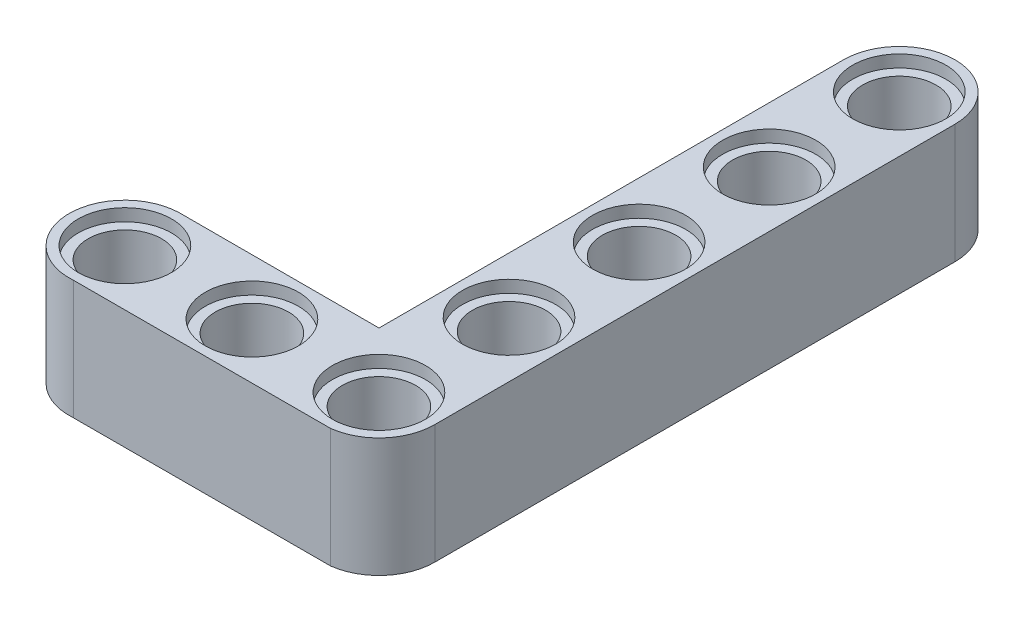
ISO-10303-21;
HEADER;
FILE_DESCRIPTION(('STEP AP214'),'2;1');
FILE_NAME('part.step','',(''),(''),'','','');
FILE_SCHEMA(('AUTOMOTIVE_DESIGN { 1 0 10303 214 1 1 1 1 }'));
ENDSEC;
DATA;
#1=APPLICATION_CONTEXT('core data for automotive mechanical design processes');
#2=APPLICATION_PROTOCOL_DEFINITION('international standard','automotive_design',2000,#1);
#3=PRODUCT_CONTEXT('',#1,'mechanical');
#4=PRODUCT('Part','Part','',(#3));
#5=PRODUCT_RELATED_PRODUCT_CATEGORY('part','',(#4));
#6=PRODUCT_DEFINITION_FORMATION('','',#4);
#7=PRODUCT_DEFINITION_CONTEXT('part definition',#1,'design');
#8=PRODUCT_DEFINITION('design','',#6,#7);
#9=PRODUCT_DEFINITION_SHAPE('','',#8);
#10=(LENGTH_UNIT() NAMED_UNIT(*) SI_UNIT(.MILLI.,.METRE.));
#11=(NAMED_UNIT(*) PLANE_ANGLE_UNIT() SI_UNIT($,.RADIAN.));
#12=(NAMED_UNIT(*) SI_UNIT($,.STERADIAN.) SOLID_ANGLE_UNIT());
#13=UNCERTAINTY_MEASURE_WITH_UNIT(LENGTH_MEASURE(1.E-05),#10,'distance_accuracy_value','');
#14=(GEOMETRIC_REPRESENTATION_CONTEXT(3) GLOBAL_UNCERTAINTY_ASSIGNED_CONTEXT((#13)) GLOBAL_UNIT_ASSIGNED_CONTEXT((#10,
#11,#12)) REPRESENTATION_CONTEXT('',''));
#15=CARTESIAN_POINT('',(0.,0.,0.));
#16=DIRECTION('',(0.,0.,1.));
#17=DIRECTION('',(1.,0.,0.));
#18=AXIS2_PLACEMENT_3D('',#15,#16,#17);
#19=CARTESIAN_POINT('',(-39.1656373147508,7.8,18.6318212216924));
#20=DIRECTION('',(0.,-1.,0.));
#21=DIRECTION('',(0.,0.,-1.));
#22=AXIS2_PLACEMENT_3D('',#19,#20,#21);
#23=CYLINDRICAL_SURFACE('',#22,2.4);
#24=CARTESIAN_POINT('',(-39.1656373147508,7.,18.6318212216924));
#25=DIRECTION('',(0.,1.,0.));
#26=DIRECTION('',(0.,0.,1.));
#27=AXIS2_PLACEMENT_3D('',#24,#25,#26);
#28=CIRCLE('',#27,2.4);
#29=CARTESIAN_POINT('',(-39.1656373147508,7.,21.0318212216924));
#30=VERTEX_POINT('',#29);
#31=EDGE_CURVE('E130',#30,#30,#28,.T.);
#32=ORIENTED_EDGE('',*,*,#31,.T.);
#33=EDGE_LOOP('',(#32));
#34=FACE_BOUND('',#33,.T.);
#35=CARTESIAN_POINT('',(-39.1656373147508,0.8,18.6318212216924));
#36=DIRECTION('',(0.,-1.,0.));
#37=DIRECTION('',(0.,0.,-1.));
#38=AXIS2_PLACEMENT_3D('',#35,#36,#37);
#39=CIRCLE('',#38,2.4);
#40=CARTESIAN_POINT('',(-39.1656373147508,0.8,16.2318212216924));
#41=VERTEX_POINT('',#40);
#42=EDGE_CURVE('E37',#41,#41,#39,.T.);
#43=ORIENTED_EDGE('',*,*,#42,.T.);
#44=EDGE_LOOP('',(#43));
#45=FACE_BOUND('',#44,.T.);
#46=ADVANCED_FACE('F33',(#34,#45),#23,.F.);
#47=CARTESIAN_POINT('',(-30.8506373147508,7.8,18.6318212216924));
#48=DIRECTION('',(0.,-1.,0.));
#49=DIRECTION('',(0.,0.,-1.));
#50=AXIS2_PLACEMENT_3D('',#47,#48,#49);
#51=CYLINDRICAL_SURFACE('',#50,2.4);
#52=CARTESIAN_POINT('',(-30.8506373147508,7.,18.6318212216924));
#53=DIRECTION('',(0.,1.,0.));
#54=DIRECTION('',(0.,0.,1.));
#55=AXIS2_PLACEMENT_3D('',#52,#53,#54);
#56=CIRCLE('',#55,2.4);
#57=CARTESIAN_POINT('',(-30.8506373147508,7.,21.0318212216924));
#58=VERTEX_POINT('',#57);
#59=EDGE_CURVE('E164',#58,#58,#56,.T.);
#60=ORIENTED_EDGE('',*,*,#59,.T.);
#61=EDGE_LOOP('',(#60));
#62=FACE_BOUND('',#61,.T.);
#63=CARTESIAN_POINT('',(-30.8506373147508,0.8,18.6318212216924));
#64=DIRECTION('',(0.,-1.,0.));
#65=DIRECTION('',(0.,0.,-1.));
#66=AXIS2_PLACEMENT_3D('',#63,#64,#65);
#67=CIRCLE('',#66,2.4);
#68=CARTESIAN_POINT('',(-30.8506373147508,0.8,16.2318212216924));
#69=VERTEX_POINT('',#68);
#70=EDGE_CURVE('E184',#69,#69,#67,.T.);
#71=ORIENTED_EDGE('',*,*,#70,.T.);
#72=EDGE_LOOP('',(#71));
#73=FACE_BOUND('',#72,.T.);
#74=ADVANCED_FACE('F233',(#62,#73),#51,.F.);
#75=CARTESIAN_POINT('',(-22.5356373147508,7.8,18.6318212216924));
#76=DIRECTION('',(0.,-1.,0.));
#77=DIRECTION('',(0.,0.,-1.));
#78=AXIS2_PLACEMENT_3D('',#75,#76,#77);
#79=CYLINDRICAL_SURFACE('',#78,2.4);
#80=CARTESIAN_POINT('',(-22.5356373147508,7.,18.6318212216924));
#81=DIRECTION('',(0.,1.,0.));
#82=DIRECTION('',(0.,0.,1.));
#83=AXIS2_PLACEMENT_3D('',#80,#81,#82);
#84=CIRCLE('',#83,2.4);
#85=CARTESIAN_POINT('',(-22.5356373147508,7.,21.0318212216924));
#86=VERTEX_POINT('',#85);
#87=EDGE_CURVE('E161',#86,#86,#84,.T.);
#88=ORIENTED_EDGE('',*,*,#87,.T.);
#89=EDGE_LOOP('',(#88));
#90=FACE_BOUND('',#89,.T.);
#91=CARTESIAN_POINT('',(-22.5356373147508,0.8,18.6318212216924));
#92=DIRECTION('',(0.,-1.,0.));
#93=DIRECTION('',(0.,0.,-1.));
#94=AXIS2_PLACEMENT_3D('',#91,#92,#93);
#95=CIRCLE('',#94,2.4);
#96=CARTESIAN_POINT('',(-22.5356373147508,0.8,16.2318212216924));
#97=VERTEX_POINT('',#96);
#98=EDGE_CURVE('E182',#97,#97,#95,.T.);
#99=ORIENTED_EDGE('',*,*,#98,.T.);
#100=EDGE_LOOP('',(#99));
#101=FACE_BOUND('',#100,.T.);
#102=ADVANCED_FACE('F239',(#90,#101),#79,.F.);
#103=CARTESIAN_POINT('',(-22.5356373147508,7.8,-6.91317877830761));
#104=DIRECTION('',(0.,-1.,0.));
#105=DIRECTION('',(0.,0.,-1.));
#106=AXIS2_PLACEMENT_3D('',#103,#104,#105);
#107=CYLINDRICAL_SURFACE('',#106,2.4);
#108=CARTESIAN_POINT('',(-22.5356373147508,7.,-6.91317877830761));
#109=DIRECTION('',(0.,1.,0.));
#110=DIRECTION('',(0.,0.,1.));
#111=AXIS2_PLACEMENT_3D('',#108,#109,#110);
#112=CIRCLE('',#111,2.4);
#113=CARTESIAN_POINT('',(-22.5356373147508,7.,-4.51317877830761));
#114=VERTEX_POINT('',#113);
#115=EDGE_CURVE('E158',#114,#114,#112,.T.);
#116=ORIENTED_EDGE('',*,*,#115,.T.);
#117=EDGE_LOOP('',(#116));
#118=FACE_BOUND('',#117,.T.);
#119=CARTESIAN_POINT('',(-22.5356373147508,0.8,-6.91317877830761));
#120=DIRECTION('',(0.,-1.,0.));
#121=DIRECTION('',(0.,0.,-1.));
#122=AXIS2_PLACEMENT_3D('',#119,#120,#121);
#123=CIRCLE('',#122,2.4);
#124=CARTESIAN_POINT('',(-22.5356373147508,0.8,-9.31317877830761));
#125=VERTEX_POINT('',#124);
#126=EDGE_CURVE('E179',#125,#125,#123,.T.);
#127=ORIENTED_EDGE('',*,*,#126,.T.);
#128=EDGE_LOOP('',(#127));
#129=FACE_BOUND('',#128,.T.);
#130=ADVANCED_FACE('F362',(#118,#129),#107,.F.);
#131=CARTESIAN_POINT('',(-22.5356373147508,7.8,1.60182122169239));
#132=DIRECTION('',(0.,-1.,0.));
#133=DIRECTION('',(0.,0.,-1.));
#134=AXIS2_PLACEMENT_3D('',#131,#132,#133);
#135=CYLINDRICAL_SURFACE('',#134,2.4);
#136=CARTESIAN_POINT('',(-22.5356373147508,7.,1.60182122169239));
#137=DIRECTION('',(0.,1.,0.));
#138=DIRECTION('',(0.,0.,1.));
#139=AXIS2_PLACEMENT_3D('',#136,#137,#138);
#140=CIRCLE('',#139,2.4);
#141=CARTESIAN_POINT('',(-22.5356373147508,7.,4.00182122169239));
#142=VERTEX_POINT('',#141);
#143=EDGE_CURVE('E155',#142,#142,#140,.T.);
#144=ORIENTED_EDGE('',*,*,#143,.T.);
#145=EDGE_LOOP('',(#144));
#146=FACE_BOUND('',#145,.T.);
#147=CARTESIAN_POINT('',(-22.5356373147508,0.8,1.60182122169239));
#148=DIRECTION('',(0.,-1.,0.));
#149=DIRECTION('',(0.,0.,-1.));
#150=AXIS2_PLACEMENT_3D('',#147,#148,#149);
#151=CIRCLE('',#150,2.4);
#152=CARTESIAN_POINT('',(-22.5356373147508,0.8,-0.798178778307611));
#153=VERTEX_POINT('',#152);
#154=EDGE_CURVE('E176',#153,#153,#151,.T.);
#155=ORIENTED_EDGE('',*,*,#154,.T.);
#156=EDGE_LOOP('',(#155));
#157=FACE_BOUND('',#156,.T.);
#158=ADVANCED_FACE('F358',(#146,#157),#135,.F.);
#159=CARTESIAN_POINT('',(-22.5356373147508,7.8,-15.4281787783076));
#160=DIRECTION('',(0.,-1.,0.));
#161=DIRECTION('',(0.,0.,-1.));
#162=AXIS2_PLACEMENT_3D('',#159,#160,#161);
#163=CYLINDRICAL_SURFACE('',#162,2.40000000000001);
#164=CARTESIAN_POINT('',(-22.5356373147508,7.,-15.4281787783076));
#165=DIRECTION('',(0.,1.,0.));
#166=DIRECTION('',(0.,0.,1.));
#167=AXIS2_PLACEMENT_3D('',#164,#165,#166);
#168=CIRCLE('',#167,2.40000000000001);
#169=CARTESIAN_POINT('',(-22.5356373147508,7.,-13.0281787783076));
#170=VERTEX_POINT('',#169);
#171=EDGE_CURVE('E151',#170,#170,#168,.T.);
#172=ORIENTED_EDGE('',*,*,#171,.T.);
#173=EDGE_LOOP('',(#172));
#174=FACE_BOUND('',#173,.T.);
#175=CARTESIAN_POINT('',(-22.5356373147508,0.8,-15.4281787783076));
#176=DIRECTION('',(0.,-1.,0.));
#177=DIRECTION('',(0.,0.,-1.));
#178=AXIS2_PLACEMENT_3D('',#175,#176,#177);
#179=CIRCLE('',#178,2.40000000000001);
#180=CARTESIAN_POINT('',(-22.5356373147508,0.8,-17.8281787783076));
#181=VERTEX_POINT('',#180);
#182=EDGE_CURVE('E172',#181,#181,#179,.T.);
#183=ORIENTED_EDGE('',*,*,#182,.T.);
#184=EDGE_LOOP('',(#183));
#185=FACE_BOUND('',#184,.T.);
#186=ADVANCED_FACE('F354',(#174,#185),#163,.F.);
#187=CARTESIAN_POINT('',(-22.5356373147508,7.8,10.1168212216924));
#188=DIRECTION('',(0.,-1.,0.));
#189=DIRECTION('',(0.,0.,-1.));
#190=AXIS2_PLACEMENT_3D('',#187,#188,#189);
#191=CYLINDRICAL_SURFACE('',#190,2.4);
#192=CARTESIAN_POINT('',(-22.5356373147508,7.,10.1168212216924));
#193=DIRECTION('',(0.,1.,0.));
#194=DIRECTION('',(0.,0.,1.));
#195=AXIS2_PLACEMENT_3D('',#192,#193,#194);
#196=CIRCLE('',#195,2.4);
#197=CARTESIAN_POINT('',(-22.5356373147508,7.,12.5168212216924));
#198=VERTEX_POINT('',#197);
#199=EDGE_CURVE('E148',#198,#198,#196,.T.);
#200=ORIENTED_EDGE('',*,*,#199,.T.);
#201=EDGE_LOOP('',(#200));
#202=FACE_BOUND('',#201,.T.);
#203=CARTESIAN_POINT('',(-22.5356373147508,0.8,10.1168212216924));
#204=DIRECTION('',(0.,-1.,0.));
#205=DIRECTION('',(0.,0.,-1.));
#206=AXIS2_PLACEMENT_3D('',#203,#204,#205);
#207=CIRCLE('',#206,2.4);
#208=CARTESIAN_POINT('',(-22.5356373147508,0.8,7.71682122169239));
#209=VERTEX_POINT('',#208);
#210=EDGE_CURVE('E169',#209,#209,#207,.T.);
#211=ORIENTED_EDGE('',*,*,#210,.T.);
#212=EDGE_LOOP('',(#211));
#213=FACE_BOUND('',#212,.T.);
#214=ADVANCED_FACE('F245',(#202,#213),#191,.F.);
#215=CARTESIAN_POINT('',(-39.1656373147508,7.8,18.6318212216924));
#216=DIRECTION('',(0.,1.,0.));
#217=DIRECTION('',(0.,0.,1.));
#218=AXIS2_PLACEMENT_3D('',#215,#216,#217);
#219=PLANE('',#218);
#220=CARTESIAN_POINT('',(-39.1656373147508,7.8,18.6318212216924));
#221=DIRECTION('',(0.,1.,0.));
#222=DIRECTION('',(0.,0.,1.));
#223=AXIS2_PLACEMENT_3D('',#220,#221,#222);
#224=CIRCLE('',#223,3.05);
#225=CARTESIAN_POINT('',(-39.1656373147508,7.8,21.6818212216924));
#226=VERTEX_POINT('',#225);
#227=EDGE_CURVE('E291',#226,#226,#224,.T.);
#228=ORIENTED_EDGE('',*,*,#227,.F.);
#229=EDGE_LOOP('',(#228));
#230=FACE_BOUND('',#229,.T.);
#231=CARTESIAN_POINT('',(-30.8506373147508,7.8,18.6318212216924));
#232=DIRECTION('',(0.,1.,0.));
#233=DIRECTION('',(0.,0.,1.));
#234=AXIS2_PLACEMENT_3D('',#231,#232,#233);
#235=CIRCLE('',#234,3.05);
#236=CARTESIAN_POINT('',(-30.8506373147508,7.8,21.6818212216924));
#237=VERTEX_POINT('',#236);
#238=EDGE_CURVE('E297',#237,#237,#235,.T.);
#239=ORIENTED_EDGE('',*,*,#238,.F.);
#240=EDGE_LOOP('',(#239));
#241=FACE_BOUND('',#240,.T.);
#242=CARTESIAN_POINT('',(-22.5356373147508,7.8,18.6318212216924));
#243=DIRECTION('',(0.,1.,0.));
#244=DIRECTION('',(0.,0.,1.));
#245=AXIS2_PLACEMENT_3D('',#242,#243,#244);
#246=CIRCLE('',#245,3.05);
#247=CARTESIAN_POINT('',(-22.5356373147508,7.8,21.6818212216924));
#248=VERTEX_POINT('',#247);
#249=EDGE_CURVE('E303',#248,#248,#246,.T.);
#250=ORIENTED_EDGE('',*,*,#249,.F.);
#251=EDGE_LOOP('',(#250));
#252=FACE_BOUND('',#251,.T.);
#253=CARTESIAN_POINT('',(-22.5356373147508,7.8,10.1168212216924));
#254=DIRECTION('',(0.,1.,0.));
#255=DIRECTION('',(0.,0.,1.));
#256=AXIS2_PLACEMENT_3D('',#253,#254,#255);
#257=CIRCLE('',#256,3.05);
#258=CARTESIAN_POINT('',(-22.5356373147508,7.8,13.1668212216924));
#259=VERTEX_POINT('',#258);
#260=EDGE_CURVE('E309',#259,#259,#257,.T.);
#261=ORIENTED_EDGE('',*,*,#260,.F.);
#262=EDGE_LOOP('',(#261));
#263=FACE_BOUND('',#262,.T.);
#264=CARTESIAN_POINT('',(-22.5356373147508,7.8,1.60182122169239));
#265=DIRECTION('',(0.,1.,0.));
#266=DIRECTION('',(0.,0.,1.));
#267=AXIS2_PLACEMENT_3D('',#264,#265,#266);
#268=CIRCLE('',#267,3.05);
#269=CARTESIAN_POINT('',(-22.5356373147508,7.8,4.65182122169239));
#270=VERTEX_POINT('',#269);
#271=EDGE_CURVE('E315',#270,#270,#268,.T.);
#272=ORIENTED_EDGE('',*,*,#271,.F.);
#273=EDGE_LOOP('',(#272));
#274=FACE_BOUND('',#273,.T.);
#275=CARTESIAN_POINT('',(-22.5356373147508,7.8,-6.91317877830761));
#276=DIRECTION('',(0.,1.,0.));
#277=DIRECTION('',(0.,0.,1.));
#278=AXIS2_PLACEMENT_3D('',#275,#276,#277);
#279=CIRCLE('',#278,3.05);
#280=CARTESIAN_POINT('',(-22.5356373147508,7.8,-3.86317877830761));
#281=VERTEX_POINT('',#280);
#282=EDGE_CURVE('E198',#281,#281,#279,.T.);
#283=ORIENTED_EDGE('',*,*,#282,.F.);
#284=EDGE_LOOP('',(#283));
#285=FACE_BOUND('',#284,.T.);
#286=CARTESIAN_POINT('',(-22.5356373147508,7.8,-15.4281787783076));
#287=DIRECTION('',(0.,1.,0.));
#288=DIRECTION('',(0.,0.,1.));
#289=AXIS2_PLACEMENT_3D('',#286,#287,#288);
#290=CIRCLE('',#289,3.05);
#291=CARTESIAN_POINT('',(-22.5356373147508,7.8,-12.3781787783076));
#292=VERTEX_POINT('',#291);
#293=EDGE_CURVE('E189',#292,#292,#290,.T.);
#294=ORIENTED_EDGE('',*,*,#293,.F.);
#295=EDGE_LOOP('',(#294));
#296=FACE_BOUND('',#295,.T.);
#297=CARTESIAN_POINT('',(-39.1656373147508,7.8,18.6318212216924));
#298=DIRECTION('',(0.,1.,0.));
#299=DIRECTION('',(0.,0.,1.));
#300=AXIS2_PLACEMENT_3D('',#297,#298,#299);
#301=CIRCLE('',#300,3.6510832871465);
#302=CARTESIAN_POINT('',(-39.2560748339214,7.8,14.9818581773854));
#303=VERTEX_POINT('',#302);
#304=CARTESIAN_POINT('',(-38.8975474180646,7.8,22.2730486214815));
#305=VERTEX_POINT('',#304);
#306=EDGE_CURVE('E139',#303,#305,#301,.T.);
#307=ORIENTED_EDGE('',*,*,#306,.T.);
#308=DIRECTION('',(0.999999484570889,0.,-0.00101531175290312));
#309=VECTOR('',#308,1.);
#310=CARTESIAN_POINT('',(-38.8975474180646,7.8,22.2730486214815));
#311=LINE('',#310,#309);
#312=CARTESIAN_POINT('',(-22.0733487780477,7.8,22.2559668060647));
#313=VERTEX_POINT('',#312);
#314=EDGE_CURVE('E92',#305,#313,#311,.T.);
#315=ORIENTED_EDGE('',*,*,#314,.T.);
#316=CARTESIAN_POINT('',(-22.5356373147508,7.8,18.6318212216924));
#317=DIRECTION('',(0.,1.,0.));
#318=DIRECTION('',(0.,0.,1.));
#319=AXIS2_PLACEMENT_3D('',#316,#317,#318);
#320=CIRCLE('',#319,3.65351090157021);
#321=CARTESIAN_POINT('',(-18.8822452029713,7.8,18.6023596283938));
#322=VERTEX_POINT('',#321);
#323=EDGE_CURVE('E204',#313,#322,#320,.T.);
#324=ORIENTED_EDGE('',*,*,#323,.T.);
#325=DIRECTION('',(-9.97061310715628E-05,0.,-0.999999995029344));
#326=VECTOR('',#325,1.);
#327=CARTESIAN_POINT('',(-18.8822452029713,7.8,18.6023596283938));
#328=LINE('',#327,#326);
#329=CARTESIAN_POINT('',(-18.8856382560439,7.8,-15.4281760992094));
#330=VERTEX_POINT('',#329);
#331=EDGE_CURVE('E108',#322,#330,#328,.T.);
#332=ORIENTED_EDGE('',*,*,#331,.T.);
#333=CARTESIAN_POINT('',(-22.5356373147508,7.8,-15.4281787783076));
#334=DIRECTION('',(0.,1.,0.));
#335=DIRECTION('',(0.,0.,1.));
#336=AXIS2_PLACEMENT_3D('',#333,#334,#335);
#337=CIRCLE('',#336,3.64999905870793);
#338=CARTESIAN_POINT('',(-26.1856363734578,7.8,-15.4281814573972));
#339=VERTEX_POINT('',#338);
#340=EDGE_CURVE('E102',#330,#339,#337,.T.);
#341=ORIENTED_EDGE('',*,*,#340,.T.);
#342=DIRECTION('',(9.97061310715225E-05,0.,0.999999995029344));
#343=VECTOR('',#342,1.);
#344=CARTESIAN_POINT('',(-26.1826044360124,7.8,14.9805546722259));
#345=LINE('',#344,#343);
#346=CARTESIAN_POINT('',(-26.1826044360124,7.8,14.9805546722259));
#347=VERTEX_POINT('',#346);
#348=EDGE_CURVE('E106',#339,#347,#345,.T.);
#349=ORIENTED_EDGE('',*,*,#348,.T.);
#350=DIRECTION('',(-0.999999995029344,0.,9.97061310714291E-05));
#351=VECTOR('',#350,1.);
#352=CARTESIAN_POINT('',(-39.2560748339214,7.8,14.9818581773854));
#353=LINE('',#352,#351);
#354=EDGE_CURVE('E52',#347,#303,#353,.T.);
#355=ORIENTED_EDGE('',*,*,#354,.T.);
#356=EDGE_LOOP('',(#307,#315,#324,#332,#341,#349,#355));
#357=FACE_BOUND('',#356,.T.);
#358=ADVANCED_FACE('F104',(#230,#241,#252,#263,#274,#285,#296,#357),#219,.T.);
#359=CARTESIAN_POINT('',(-39.1656373147508,0.,18.6318212216924));
#360=DIRECTION('',(0.,1.,0.));
#361=DIRECTION('',(0.,0.,1.));
#362=AXIS2_PLACEMENT_3D('',#359,#360,#361);
#363=PLANE('',#362);
#364=CARTESIAN_POINT('',(-22.5356373147508,0.,-15.4281787783076));
#365=DIRECTION('',(0.,-1.,0.));
#366=DIRECTION('',(0.,0.,-1.));
#367=AXIS2_PLACEMENT_3D('',#364,#365,#366);
#368=CIRCLE('',#367,3.05);
#369=CARTESIAN_POINT('',(-22.5356373147508,0.,-18.4781787783076));
#370=VERTEX_POINT('',#369);
#371=EDGE_CURVE('E256',#370,#370,#368,.T.);
#372=ORIENTED_EDGE('',*,*,#371,.F.);
#373=EDGE_LOOP('',(#372));
#374=FACE_BOUND('',#373,.T.);
#375=CARTESIAN_POINT('',(-22.5356373147508,0.,-6.91317877830761));
#376=DIRECTION('',(0.,-1.,0.));
#377=DIRECTION('',(0.,0.,-1.));
#378=AXIS2_PLACEMENT_3D('',#375,#376,#377);
#379=CIRCLE('',#378,3.05);
#380=CARTESIAN_POINT('',(-22.5356373147508,0.,-9.96317877830761));
#381=VERTEX_POINT('',#380);
#382=EDGE_CURVE('E260',#381,#381,#379,.T.);
#383=ORIENTED_EDGE('',*,*,#382,.F.);
#384=EDGE_LOOP('',(#383));
#385=FACE_BOUND('',#384,.T.);
#386=CARTESIAN_POINT('',(-22.5356373147508,0.,1.60182122169239));
#387=DIRECTION('',(0.,-1.,0.));
#388=DIRECTION('',(0.,0.,-1.));
#389=AXIS2_PLACEMENT_3D('',#386,#387,#388);
#390=CIRCLE('',#389,3.05);
#391=CARTESIAN_POINT('',(-22.5356373147508,0.,-1.44817877830761));
#392=VERTEX_POINT('',#391);
#393=EDGE_CURVE('E264',#392,#392,#390,.T.);
#394=ORIENTED_EDGE('',*,*,#393,.F.);
#395=EDGE_LOOP('',(#394));
#396=FACE_BOUND('',#395,.T.);
#397=CARTESIAN_POINT('',(-22.5356373147508,0.,10.1168212216924));
#398=DIRECTION('',(0.,-1.,0.));
#399=DIRECTION('',(0.,0.,-1.));
#400=AXIS2_PLACEMENT_3D('',#397,#398,#399);
#401=CIRCLE('',#400,3.05);
#402=CARTESIAN_POINT('',(-22.5356373147508,0.,7.06682122169239));
#403=VERTEX_POINT('',#402);
#404=EDGE_CURVE('E268',#403,#403,#401,.T.);
#405=ORIENTED_EDGE('',*,*,#404,.F.);
#406=EDGE_LOOP('',(#405));
#407=FACE_BOUND('',#406,.T.);
#408=CARTESIAN_POINT('',(-22.5356373147508,0.,18.6318212216924));
#409=DIRECTION('',(0.,-1.,0.));
#410=DIRECTION('',(0.,0.,-1.));
#411=AXIS2_PLACEMENT_3D('',#408,#409,#410);
#412=CIRCLE('',#411,3.05);
#413=CARTESIAN_POINT('',(-22.5356373147508,0.,15.5818212216924));
#414=VERTEX_POINT('',#413);
#415=EDGE_CURVE('E272',#414,#414,#412,.T.);
#416=ORIENTED_EDGE('',*,*,#415,.F.);
#417=EDGE_LOOP('',(#416));
#418=FACE_BOUND('',#417,.T.);
#419=CARTESIAN_POINT('',(-39.1656373147508,0.,18.6318212216924));
#420=DIRECTION('',(0.,-1.,0.));
#421=DIRECTION('',(0.,0.,-1.));
#422=AXIS2_PLACEMENT_3D('',#419,#420,#421);
#423=CIRCLE('',#422,3.05);
#424=CARTESIAN_POINT('',(-39.1656373147508,0.,15.5818212216924));
#425=VERTEX_POINT('',#424);
#426=EDGE_CURVE('E276',#425,#425,#423,.T.);
#427=ORIENTED_EDGE('',*,*,#426,.F.);
#428=EDGE_LOOP('',(#427));
#429=FACE_BOUND('',#428,.T.);
#430=CARTESIAN_POINT('',(-30.8506373147508,0.,18.6318212216924));
#431=DIRECTION('',(0.,-1.,0.));
#432=DIRECTION('',(0.,0.,-1.));
#433=AXIS2_PLACEMENT_3D('',#430,#431,#432);
#434=CIRCLE('',#433,3.05);
#435=CARTESIAN_POINT('',(-30.8506373147508,0.,15.5818212216924));
#436=VERTEX_POINT('',#435);
#437=EDGE_CURVE('E279',#436,#436,#434,.T.);
#438=ORIENTED_EDGE('',*,*,#437,.F.);
#439=EDGE_LOOP('',(#438));
#440=FACE_BOUND('',#439,.T.);
#441=CARTESIAN_POINT('',(-39.1656373147508,0.,18.6318212216924));
#442=DIRECTION('',(0.,1.,0.));
#443=DIRECTION('',(0.,0.,1.));
#444=AXIS2_PLACEMENT_3D('',#441,#442,#443);
#445=CIRCLE('',#444,3.6510832871465);
#446=CARTESIAN_POINT('',(-39.2560748339214,0.,14.9818581773854));
#447=VERTEX_POINT('',#446);
#448=CARTESIAN_POINT('',(-38.8975474180646,0.,22.2730486214815));
#449=VERTEX_POINT('',#448);
#450=EDGE_CURVE('E126',#447,#449,#445,.T.);
#451=ORIENTED_EDGE('',*,*,#450,.F.);
#452=DIRECTION('',(-0.999999995029344,0.,9.97061310714291E-05));
#453=VECTOR('',#452,1.);
#454=CARTESIAN_POINT('',(-39.2560748339214,0.,14.9818581773854));
#455=LINE('',#454,#453);
#456=CARTESIAN_POINT('',(-26.1826044360124,0.,14.9805546722259));
#457=VERTEX_POINT('',#456);
#458=EDGE_CURVE('E84',#457,#447,#455,.T.);
#459=ORIENTED_EDGE('',*,*,#458,.F.);
#460=DIRECTION('',(9.97061310715225E-05,0.,0.999999995029344));
#461=VECTOR('',#460,1.);
#462=CARTESIAN_POINT('',(-26.1826044360124,0.,14.9805546722259));
#463=LINE('',#462,#461);
#464=CARTESIAN_POINT('',(-26.1856363734578,0.,-15.4281814573972));
#465=VERTEX_POINT('',#464);
#466=EDGE_CURVE('E78',#465,#457,#463,.T.);
#467=ORIENTED_EDGE('',*,*,#466,.F.);
#468=CARTESIAN_POINT('',(-22.5356373147508,0.,-15.4281787783076));
#469=DIRECTION('',(0.,1.,0.));
#470=DIRECTION('',(0.,0.,1.));
#471=AXIS2_PLACEMENT_3D('',#468,#469,#470);
#472=CIRCLE('',#471,3.64999905870793);
#473=CARTESIAN_POINT('',(-18.8856382560439,0.,-15.4281760992094));
#474=VERTEX_POINT('',#473);
#475=EDGE_CURVE('E116',#474,#465,#472,.T.);
#476=ORIENTED_EDGE('',*,*,#475,.F.);
#477=DIRECTION('',(-9.97061310715628E-05,0.,-0.999999995029344));
#478=VECTOR('',#477,1.);
#479=CARTESIAN_POINT('',(-18.8822452029713,0.,18.6023596283938));
#480=LINE('',#479,#478);
#481=CARTESIAN_POINT('',(-18.8822452029713,0.,18.6023596283938));
#482=VERTEX_POINT('',#481);
#483=EDGE_CURVE('E134',#482,#474,#480,.T.);
#484=ORIENTED_EDGE('',*,*,#483,.F.);
#485=CARTESIAN_POINT('',(-22.5356373147508,0.,18.6318212216924));
#486=DIRECTION('',(0.,1.,0.));
#487=DIRECTION('',(0.,0.,1.));
#488=AXIS2_PLACEMENT_3D('',#485,#486,#487);
#489=CIRCLE('',#488,3.65351090157021);
#490=CARTESIAN_POINT('',(-22.0733487780477,0.,22.2559668060647));
#491=VERTEX_POINT('',#490);
#492=EDGE_CURVE('E132',#491,#482,#489,.T.);
#493=ORIENTED_EDGE('',*,*,#492,.F.);
#494=DIRECTION('',(0.999999484570889,0.,-0.00101531175290312));
#495=VECTOR('',#494,1.);
#496=CARTESIAN_POINT('',(-38.8975474180646,0.,22.2730486214815));
#497=LINE('',#496,#495);
#498=EDGE_CURVE('E129',#449,#491,#497,.T.);
#499=ORIENTED_EDGE('',*,*,#498,.F.);
#500=EDGE_LOOP('',(#451,#459,#467,#476,#484,#493,#499));
#501=FACE_BOUND('',#500,.T.);
#502=ADVANCED_FACE('F215',(#374,#385,#396,#407,#418,#429,#440,#501),#363,.F.);
#503=CARTESIAN_POINT('',(-39.1656373147508,7.8,18.6318212216924));
#504=DIRECTION('',(0.,-1.,0.));
#505=DIRECTION('',(0.,0.,-1.));
#506=AXIS2_PLACEMENT_3D('',#503,#504,#505);
#507=CYLINDRICAL_SURFACE('',#506,3.6510832871465);
#508=ORIENTED_EDGE('',*,*,#450,.T.);
#509=DIRECTION('',(0.,-1.,0.));
#510=VECTOR('',#509,1.);
#511=CARTESIAN_POINT('',(-38.8975474180646,7.8,22.2730486214815));
#512=LINE('',#511,#510);
#513=EDGE_CURVE('E11',#305,#449,#512,.T.);
#514=ORIENTED_EDGE('',*,*,#513,.F.);
#515=ORIENTED_EDGE('',*,*,#306,.F.);
#516=DIRECTION('',(0.,-1.,0.));
#517=VECTOR('',#516,1.);
#518=CARTESIAN_POINT('',(-39.2560748339214,7.8,14.9818581773854));
#519=LINE('',#518,#517);
#520=EDGE_CURVE('E122',#303,#447,#519,.T.);
#521=ORIENTED_EDGE('',*,*,#520,.T.);
#522=EDGE_LOOP('',(#508,#514,#515,#521));
#523=FACE_BOUND('',#522,.T.);
#524=ADVANCED_FACE('F35',(#523),#507,.T.);
#525=CARTESIAN_POINT('',(-38.8975474180646,7.8,22.2730486214815));
#526=DIRECTION('',(-0.00101531175290312,0.,-0.999999484570889));
#527=DIRECTION('',(-0.999999484570889,0.,0.00101531175290312));
#528=AXIS2_PLACEMENT_3D('',#525,#526,#527);
#529=PLANE('',#528);
#530=ORIENTED_EDGE('',*,*,#498,.T.);
#531=DIRECTION('',(0.,-1.,0.));
#532=VECTOR('',#531,1.);
#533=CARTESIAN_POINT('',(-22.0733487780477,7.8,22.2559668060647));
#534=LINE('',#533,#532);
#535=EDGE_CURVE('E43',#313,#491,#534,.T.);
#536=ORIENTED_EDGE('',*,*,#535,.F.);
#537=ORIENTED_EDGE('',*,*,#314,.F.);
#538=ORIENTED_EDGE('',*,*,#513,.T.);
#539=EDGE_LOOP('',(#530,#536,#537,#538));
#540=FACE_BOUND('',#539,.T.);
#541=ADVANCED_FACE('F252',(#540),#529,.F.);
#542=CARTESIAN_POINT('',(-22.5356373147508,7.8,18.6318212216924));
#543=DIRECTION('',(0.,-1.,0.));
#544=DIRECTION('',(0.,0.,-1.));
#545=AXIS2_PLACEMENT_3D('',#542,#543,#544);
#546=CYLINDRICAL_SURFACE('',#545,3.65351090157021);
#547=ORIENTED_EDGE('',*,*,#492,.T.);
#548=DIRECTION('',(0.,-1.,0.));
#549=VECTOR('',#548,1.);
#550=CARTESIAN_POINT('',(-18.8822452029713,7.8,18.6023596283938));
#551=LINE('',#550,#549);
#552=EDGE_CURVE('E143',#322,#482,#551,.T.);
#553=ORIENTED_EDGE('',*,*,#552,.F.);
#554=ORIENTED_EDGE('',*,*,#323,.F.);
#555=ORIENTED_EDGE('',*,*,#535,.T.);
#556=EDGE_LOOP('',(#547,#553,#554,#555));
#557=FACE_BOUND('',#556,.T.);
#558=ADVANCED_FACE('F208',(#557),#546,.T.);
#559=CARTESIAN_POINT('',(-18.8822452029713,7.8,18.6023596283938));
#560=DIRECTION('',(-0.999999995029344,0.,9.97061310715628E-05));
#561=DIRECTION('',(9.97061310715628E-05,0.,0.999999995029344));
#562=AXIS2_PLACEMENT_3D('',#559,#560,#561);
#563=PLANE('',#562);
#564=ORIENTED_EDGE('',*,*,#483,.T.);
#565=DIRECTION('',(0.,-1.,0.));
#566=VECTOR('',#565,1.);
#567=CARTESIAN_POINT('',(-18.8856382560439,7.8,-15.4281760992094));
#568=LINE('',#567,#566);
#569=EDGE_CURVE('E117',#330,#474,#568,.T.);
#570=ORIENTED_EDGE('',*,*,#569,.F.);
#571=ORIENTED_EDGE('',*,*,#331,.F.);
#572=ORIENTED_EDGE('',*,*,#552,.T.);
#573=EDGE_LOOP('',(#564,#570,#571,#572));
#574=FACE_BOUND('',#573,.T.);
#575=ADVANCED_FACE('F212',(#574),#563,.F.);
#576=CARTESIAN_POINT('',(-22.5356373147508,7.8,-15.4281787783076));
#577=DIRECTION('',(0.,-1.,0.));
#578=DIRECTION('',(0.,0.,-1.));
#579=AXIS2_PLACEMENT_3D('',#576,#577,#578);
#580=CYLINDRICAL_SURFACE('',#579,3.64999905870793);
#581=ORIENTED_EDGE('',*,*,#475,.T.);
#582=DIRECTION('',(0.,-1.,0.));
#583=VECTOR('',#582,1.);
#584=CARTESIAN_POINT('',(-26.1856363734578,7.8,-15.4281814573972));
#585=LINE('',#584,#583);
#586=EDGE_CURVE('E113',#339,#465,#585,.T.);
#587=ORIENTED_EDGE('',*,*,#586,.F.);
#588=ORIENTED_EDGE('',*,*,#340,.F.);
#589=ORIENTED_EDGE('',*,*,#569,.T.);
#590=EDGE_LOOP('',(#581,#587,#588,#589));
#591=FACE_BOUND('',#590,.T.);
#592=ADVANCED_FACE('F114',(#591),#580,.T.);
#593=CARTESIAN_POINT('',(-26.1826044360124,7.8,14.9805546722259));
#594=DIRECTION('',(0.999999995029344,0.,-9.97061310715225E-05));
#595=DIRECTION('',(-9.97061310715225E-05,0.,-0.999999995029344));
#596=AXIS2_PLACEMENT_3D('',#593,#594,#595);
#597=PLANE('',#596);
#598=ORIENTED_EDGE('',*,*,#466,.T.);
#599=DIRECTION('',(0.,-1.,0.));
#600=VECTOR('',#599,1.);
#601=CARTESIAN_POINT('',(-26.1826044360124,7.8,14.9805546722259));
#602=LINE('',#601,#600);
#603=EDGE_CURVE('E118',#347,#457,#602,.T.);
#604=ORIENTED_EDGE('',*,*,#603,.F.);
#605=ORIENTED_EDGE('',*,*,#348,.F.);
#606=ORIENTED_EDGE('',*,*,#586,.T.);
#607=EDGE_LOOP('',(#598,#604,#605,#606));
#608=FACE_BOUND('',#607,.T.);
#609=ADVANCED_FACE('F120',(#608),#597,.F.);
#610=CARTESIAN_POINT('',(-39.2560748339214,7.8,14.9818581773854));
#611=DIRECTION('',(9.97061310714291E-05,0.,0.999999995029344));
#612=DIRECTION('',(0.999999995029344,0.,-9.97061310714291E-05));
#613=AXIS2_PLACEMENT_3D('',#610,#611,#612);
#614=PLANE('',#613);
#615=ORIENTED_EDGE('',*,*,#458,.T.);
#616=ORIENTED_EDGE('',*,*,#520,.F.);
#617=ORIENTED_EDGE('',*,*,#354,.F.);
#618=ORIENTED_EDGE('',*,*,#603,.T.);
#619=EDGE_LOOP('',(#615,#616,#617,#618));
#620=FACE_BOUND('',#619,.T.);
#621=ADVANCED_FACE('F219',(#620),#614,.F.);
#622=CARTESIAN_POINT('',(-22.5356373147508,7.,10.1168212216924));
#623=DIRECTION('',(0.,1.,0.));
#624=DIRECTION('',(0.,0.,1.));
#625=AXIS2_PLACEMENT_3D('',#622,#623,#624);
#626=CYLINDRICAL_SURFACE('',#625,3.05);
#627=CARTESIAN_POINT('',(-22.5356373147508,7.,10.1168212216924));
#628=DIRECTION('',(0.,1.,0.));
#629=DIRECTION('',(0.,0.,1.));
#630=AXIS2_PLACEMENT_3D('',#627,#628,#629);
#631=CIRCLE('',#630,3.05);
#632=CARTESIAN_POINT('',(-22.5356373147508,7.,13.1668212216924));
#633=VERTEX_POINT('',#632);
#634=EDGE_CURVE('E306',#633,#633,#631,.T.);
#635=ORIENTED_EDGE('',*,*,#634,.F.);
#636=EDGE_LOOP('',(#635));
#637=FACE_BOUND('',#636,.T.);
#638=ORIENTED_EDGE('',*,*,#260,.T.);
#639=EDGE_LOOP('',(#638));
#640=FACE_BOUND('',#639,.T.);
#641=ADVANCED_FACE('F221',(#637,#640),#626,.F.);
#642=CARTESIAN_POINT('',(-22.5356373147508,7.,10.1168212216924));
#643=DIRECTION('',(0.,1.,0.));
#644=DIRECTION('',(0.,0.,1.));
#645=AXIS2_PLACEMENT_3D('',#642,#643,#644);
#646=PLANE('',#645);
#647=ORIENTED_EDGE('',*,*,#199,.F.);
#648=EDGE_LOOP('',(#647));
#649=FACE_BOUND('',#648,.T.);
#650=ORIENTED_EDGE('',*,*,#634,.T.);
#651=EDGE_LOOP('',(#650));
#652=FACE_BOUND('',#651,.T.);
#653=ADVANCED_FACE('F227',(#649,#652),#646,.T.);
#654=CARTESIAN_POINT('',(-22.5356373147508,7.,-15.4281787783076));
#655=DIRECTION('',(0.,1.,0.));
#656=DIRECTION('',(0.,0.,1.));
#657=AXIS2_PLACEMENT_3D('',#654,#655,#656);
#658=CYLINDRICAL_SURFACE('',#657,3.05);
#659=CARTESIAN_POINT('',(-22.5356373147508,7.,-15.4281787783076));
#660=DIRECTION('',(0.,1.,0.));
#661=DIRECTION('',(0.,0.,1.));
#662=AXIS2_PLACEMENT_3D('',#659,#660,#661);
#663=CIRCLE('',#662,3.05);
#664=CARTESIAN_POINT('',(-22.5356373147508,7.,-12.3781787783076));
#665=VERTEX_POINT('',#664);
#666=EDGE_CURVE('E193',#665,#665,#663,.T.);
#667=ORIENTED_EDGE('',*,*,#666,.F.);
#668=EDGE_LOOP('',(#667));
#669=FACE_BOUND('',#668,.T.);
#670=ORIENTED_EDGE('',*,*,#293,.T.);
#671=EDGE_LOOP('',(#670));
#672=FACE_BOUND('',#671,.T.);
#673=ADVANCED_FACE('F347',(#669,#672),#658,.F.);
#674=CARTESIAN_POINT('',(-22.5356373147508,7.,-15.4281787783076));
#675=DIRECTION('',(0.,1.,0.));
#676=DIRECTION('',(0.,0.,1.));
#677=AXIS2_PLACEMENT_3D('',#674,#675,#676);
#678=PLANE('',#677);
#679=ORIENTED_EDGE('',*,*,#171,.F.);
#680=EDGE_LOOP('',(#679));
#681=FACE_BOUND('',#680,.T.);
#682=ORIENTED_EDGE('',*,*,#666,.T.);
#683=EDGE_LOOP('',(#682));
#684=FACE_BOUND('',#683,.T.);
#685=ADVANCED_FACE('F344',(#681,#684),#678,.T.);
#686=CARTESIAN_POINT('',(-22.5356373147508,7.,1.60182122169239));
#687=DIRECTION('',(0.,1.,0.));
#688=DIRECTION('',(0.,0.,1.));
#689=AXIS2_PLACEMENT_3D('',#686,#687,#688);
#690=CYLINDRICAL_SURFACE('',#689,3.05);
#691=CARTESIAN_POINT('',(-22.5356373147508,7.,1.60182122169239));
#692=DIRECTION('',(0.,1.,0.));
#693=DIRECTION('',(0.,0.,1.));
#694=AXIS2_PLACEMENT_3D('',#691,#692,#693);
#695=CIRCLE('',#694,3.05);
#696=CARTESIAN_POINT('',(-22.5356373147508,7.,4.65182122169239));
#697=VERTEX_POINT('',#696);
#698=EDGE_CURVE('E312',#697,#697,#695,.T.);
#699=ORIENTED_EDGE('',*,*,#698,.F.);
#700=EDGE_LOOP('',(#699));
#701=FACE_BOUND('',#700,.T.);
#702=ORIENTED_EDGE('',*,*,#271,.T.);
#703=EDGE_LOOP('',(#702));
#704=FACE_BOUND('',#703,.T.);
#705=ADVANCED_FACE('F338',(#701,#704),#690,.F.);
#706=CARTESIAN_POINT('',(-22.5356373147508,7.,1.60182122169239));
#707=DIRECTION('',(0.,1.,0.));
#708=DIRECTION('',(0.,0.,1.));
#709=AXIS2_PLACEMENT_3D('',#706,#707,#708);
#710=PLANE('',#709);
#711=ORIENTED_EDGE('',*,*,#143,.F.);
#712=EDGE_LOOP('',(#711));
#713=FACE_BOUND('',#712,.T.);
#714=ORIENTED_EDGE('',*,*,#698,.T.);
#715=EDGE_LOOP('',(#714));
#716=FACE_BOUND('',#715,.T.);
#717=ADVANCED_FACE('F328',(#713,#716),#710,.T.);
#718=CARTESIAN_POINT('',(-22.5356373147508,7.,-6.91317877830761));
#719=DIRECTION('',(0.,1.,0.));
#720=DIRECTION('',(0.,0.,1.));
#721=AXIS2_PLACEMENT_3D('',#718,#719,#720);
#722=CYLINDRICAL_SURFACE('',#721,3.05);
#723=CARTESIAN_POINT('',(-22.5356373147508,7.,-6.91317877830761));
#724=DIRECTION('',(0.,1.,0.));
#725=DIRECTION('',(0.,0.,1.));
#726=AXIS2_PLACEMENT_3D('',#723,#724,#725);
#727=CIRCLE('',#726,3.05);
#728=CARTESIAN_POINT('',(-22.5356373147508,7.,-3.86317877830761));
#729=VERTEX_POINT('',#728);
#730=EDGE_CURVE('E318',#729,#729,#727,.T.);
#731=ORIENTED_EDGE('',*,*,#730,.F.);
#732=EDGE_LOOP('',(#731));
#733=FACE_BOUND('',#732,.T.);
#734=ORIENTED_EDGE('',*,*,#282,.T.);
#735=EDGE_LOOP('',(#734));
#736=FACE_BOUND('',#735,.T.);
#737=ADVANCED_FACE('F323',(#733,#736),#722,.F.);
#738=CARTESIAN_POINT('',(-22.5356373147508,7.,-6.91317877830761));
#739=DIRECTION('',(0.,1.,0.));
#740=DIRECTION('',(0.,0.,1.));
#741=AXIS2_PLACEMENT_3D('',#738,#739,#740);
#742=PLANE('',#741);
#743=ORIENTED_EDGE('',*,*,#115,.F.);
#744=EDGE_LOOP('',(#743));
#745=FACE_BOUND('',#744,.T.);
#746=ORIENTED_EDGE('',*,*,#730,.T.);
#747=EDGE_LOOP('',(#746));
#748=FACE_BOUND('',#747,.T.);
#749=ADVANCED_FACE('F327',(#745,#748),#742,.T.);
#750=CARTESIAN_POINT('',(-22.5356373147508,7.,18.6318212216924));
#751=DIRECTION('',(0.,1.,0.));
#752=DIRECTION('',(0.,0.,1.));
#753=AXIS2_PLACEMENT_3D('',#750,#751,#752);
#754=CYLINDRICAL_SURFACE('',#753,3.05);
#755=CARTESIAN_POINT('',(-22.5356373147508,7.,18.6318212216924));
#756=DIRECTION('',(0.,1.,0.));
#757=DIRECTION('',(0.,0.,1.));
#758=AXIS2_PLACEMENT_3D('',#755,#756,#757);
#759=CIRCLE('',#758,3.05);
#760=CARTESIAN_POINT('',(-22.5356373147508,7.,21.6818212216924));
#761=VERTEX_POINT('',#760);
#762=EDGE_CURVE('E300',#761,#761,#759,.T.);
#763=ORIENTED_EDGE('',*,*,#762,.F.);
#764=EDGE_LOOP('',(#763));
#765=FACE_BOUND('',#764,.T.);
#766=ORIENTED_EDGE('',*,*,#249,.T.);
#767=EDGE_LOOP('',(#766));
#768=FACE_BOUND('',#767,.T.);
#769=ADVANCED_FACE('F335',(#765,#768),#754,.F.);
#770=CARTESIAN_POINT('',(-22.5356373147508,7.,18.6318212216924));
#771=DIRECTION('',(0.,1.,0.));
#772=DIRECTION('',(0.,0.,1.));
#773=AXIS2_PLACEMENT_3D('',#770,#771,#772);
#774=PLANE('',#773);
#775=ORIENTED_EDGE('',*,*,#87,.F.);
#776=EDGE_LOOP('',(#775));
#777=FACE_BOUND('',#776,.T.);
#778=ORIENTED_EDGE('',*,*,#762,.T.);
#779=EDGE_LOOP('',(#778));
#780=FACE_BOUND('',#779,.T.);
#781=ADVANCED_FACE('F445',(#777,#780),#774,.T.);
#782=CARTESIAN_POINT('',(-30.8506373147508,7.,18.6318212216924));
#783=DIRECTION('',(0.,1.,0.));
#784=DIRECTION('',(0.,0.,1.));
#785=AXIS2_PLACEMENT_3D('',#782,#783,#784);
#786=CYLINDRICAL_SURFACE('',#785,3.05);
#787=CARTESIAN_POINT('',(-30.8506373147508,7.,18.6318212216924));
#788=DIRECTION('',(0.,1.,0.));
#789=DIRECTION('',(0.,0.,1.));
#790=AXIS2_PLACEMENT_3D('',#787,#788,#789);
#791=CIRCLE('',#790,3.05);
#792=CARTESIAN_POINT('',(-30.8506373147508,7.,21.6818212216924));
#793=VERTEX_POINT('',#792);
#794=EDGE_CURVE('E294',#793,#793,#791,.T.);
#795=ORIENTED_EDGE('',*,*,#794,.F.);
#796=EDGE_LOOP('',(#795));
#797=FACE_BOUND('',#796,.T.);
#798=ORIENTED_EDGE('',*,*,#238,.T.);
#799=EDGE_LOOP('',(#798));
#800=FACE_BOUND('',#799,.T.);
#801=ADVANCED_FACE('F441',(#797,#800),#786,.F.);
#802=CARTESIAN_POINT('',(-30.8506373147508,7.,18.6318212216924));
#803=DIRECTION('',(0.,1.,0.));
#804=DIRECTION('',(0.,0.,1.));
#805=AXIS2_PLACEMENT_3D('',#802,#803,#804);
#806=PLANE('',#805);
#807=ORIENTED_EDGE('',*,*,#59,.F.);
#808=EDGE_LOOP('',(#807));
#809=FACE_BOUND('',#808,.T.);
#810=ORIENTED_EDGE('',*,*,#794,.T.);
#811=EDGE_LOOP('',(#810));
#812=FACE_BOUND('',#811,.T.);
#813=ADVANCED_FACE('F437',(#809,#812),#806,.T.);
#814=CARTESIAN_POINT('',(-39.1656373147508,7.,18.6318212216924));
#815=DIRECTION('',(0.,1.,0.));
#816=DIRECTION('',(0.,0.,1.));
#817=AXIS2_PLACEMENT_3D('',#814,#815,#816);
#818=CYLINDRICAL_SURFACE('',#817,3.05);
#819=CARTESIAN_POINT('',(-39.1656373147508,7.,18.6318212216924));
#820=DIRECTION('',(0.,1.,0.));
#821=DIRECTION('',(0.,0.,1.));
#822=AXIS2_PLACEMENT_3D('',#819,#820,#821);
#823=CIRCLE('',#822,3.05);
#824=CARTESIAN_POINT('',(-39.1656373147508,7.,21.6818212216924));
#825=VERTEX_POINT('',#824);
#826=EDGE_CURVE('E152',#825,#825,#823,.T.);
#827=ORIENTED_EDGE('',*,*,#826,.F.);
#828=EDGE_LOOP('',(#827));
#829=FACE_BOUND('',#828,.T.);
#830=ORIENTED_EDGE('',*,*,#227,.T.);
#831=EDGE_LOOP('',(#830));
#832=FACE_BOUND('',#831,.T.);
#833=ADVANCED_FACE('F433',(#829,#832),#818,.F.);
#834=CARTESIAN_POINT('',(-39.1656373147508,7.,18.6318212216924));
#835=DIRECTION('',(0.,1.,0.));
#836=DIRECTION('',(0.,0.,1.));
#837=AXIS2_PLACEMENT_3D('',#834,#835,#836);
#838=PLANE('',#837);
#839=ORIENTED_EDGE('',*,*,#31,.F.);
#840=EDGE_LOOP('',(#839));
#841=FACE_BOUND('',#840,.T.);
#842=ORIENTED_EDGE('',*,*,#826,.T.);
#843=EDGE_LOOP('',(#842));
#844=FACE_BOUND('',#843,.T.);
#845=ADVANCED_FACE('F429',(#841,#844),#838,.T.);
#846=CARTESIAN_POINT('',(-30.8506373147508,0.8,18.6318212216924));
#847=DIRECTION('',(0.,-1.,0.));
#848=DIRECTION('',(0.,0.,-1.));
#849=AXIS2_PLACEMENT_3D('',#846,#847,#848);
#850=CYLINDRICAL_SURFACE('',#849,3.05);
#851=CARTESIAN_POINT('',(-30.8506373147508,0.8,18.6318212216924));
#852=DIRECTION('',(0.,-1.,0.));
#853=DIRECTION('',(0.,0.,-1.));
#854=AXIS2_PLACEMENT_3D('',#851,#852,#853);
#855=CIRCLE('',#854,3.05);
#856=CARTESIAN_POINT('',(-30.8506373147508,0.8,15.5818212216924));
#857=VERTEX_POINT('',#856);
#858=EDGE_CURVE('E173',#857,#857,#855,.T.);
#859=ORIENTED_EDGE('',*,*,#858,.F.);
#860=EDGE_LOOP('',(#859));
#861=FACE_BOUND('',#860,.T.);
#862=ORIENTED_EDGE('',*,*,#437,.T.);
#863=EDGE_LOOP('',(#862));
#864=FACE_BOUND('',#863,.T.);
#865=ADVANCED_FACE('F425',(#861,#864),#850,.F.);
#866=CARTESIAN_POINT('',(-30.8506373147508,0.8,18.6318212216924));
#867=DIRECTION('',(0.,-1.,0.));
#868=DIRECTION('',(0.,0.,-1.));
#869=AXIS2_PLACEMENT_3D('',#866,#867,#868);
#870=PLANE('',#869);
#871=ORIENTED_EDGE('',*,*,#70,.F.);
#872=EDGE_LOOP('',(#871));
#873=FACE_BOUND('',#872,.T.);
#874=ORIENTED_EDGE('',*,*,#858,.T.);
#875=EDGE_LOOP('',(#874));
#876=FACE_BOUND('',#875,.T.);
#877=ADVANCED_FACE('F421',(#873,#876),#870,.T.);
#878=CARTESIAN_POINT('',(-39.1656373147508,0.8,18.6318212216924));
#879=DIRECTION('',(0.,-1.,0.));
#880=DIRECTION('',(0.,0.,-1.));
#881=AXIS2_PLACEMENT_3D('',#878,#879,#880);
#882=CYLINDRICAL_SURFACE('',#881,3.05);
#883=CARTESIAN_POINT('',(-39.1656373147508,0.8,18.6318212216924));
#884=DIRECTION('',(0.,-1.,0.));
#885=DIRECTION('',(0.,0.,-1.));
#886=AXIS2_PLACEMENT_3D('',#883,#884,#885);
#887=CIRCLE('',#886,3.05);
#888=CARTESIAN_POINT('',(-39.1656373147508,0.8,15.5818212216924));
#889=VERTEX_POINT('',#888);
#890=EDGE_CURVE('E281',#889,#889,#887,.T.);
#891=ORIENTED_EDGE('',*,*,#890,.F.);
#892=EDGE_LOOP('',(#891));
#893=FACE_BOUND('',#892,.T.);
#894=ORIENTED_EDGE('',*,*,#426,.T.);
#895=EDGE_LOOP('',(#894));
#896=FACE_BOUND('',#895,.T.);
#897=ADVANCED_FACE('F424',(#893,#896),#882,.F.);
#898=CARTESIAN_POINT('',(-39.1656373147508,0.8,18.6318212216924));
#899=DIRECTION('',(0.,-1.,0.));
#900=DIRECTION('',(0.,0.,-1.));
#901=AXIS2_PLACEMENT_3D('',#898,#899,#900);
#902=PLANE('',#901);
#903=ORIENTED_EDGE('',*,*,#42,.F.);
#904=EDGE_LOOP('',(#903));
#905=FACE_BOUND('',#904,.T.);
#906=ORIENTED_EDGE('',*,*,#890,.T.);
#907=EDGE_LOOP('',(#906));
#908=FACE_BOUND('',#907,.T.);
#909=ADVANCED_FACE('F581',(#905,#908),#902,.T.);
#910=CARTESIAN_POINT('',(-22.5356373147508,0.8,18.6318212216924));
#911=DIRECTION('',(0.,-1.,0.));
#912=DIRECTION('',(0.,0.,-1.));
#913=AXIS2_PLACEMENT_3D('',#910,#911,#912);
#914=CYLINDRICAL_SURFACE('',#913,3.05);
#915=CARTESIAN_POINT('',(-22.5356373147508,0.8,18.6318212216924));
#916=DIRECTION('',(0.,-1.,0.));
#917=DIRECTION('',(0.,0.,-1.));
#918=AXIS2_PLACEMENT_3D('',#915,#916,#917);
#919=CIRCLE('',#918,3.05);
#920=CARTESIAN_POINT('',(-22.5356373147508,0.8,15.5818212216924));
#921=VERTEX_POINT('',#920);
#922=EDGE_CURVE('E382',#921,#921,#919,.T.);
#923=ORIENTED_EDGE('',*,*,#922,.F.);
#924=EDGE_LOOP('',(#923));
#925=FACE_BOUND('',#924,.T.);
#926=ORIENTED_EDGE('',*,*,#415,.T.);
#927=EDGE_LOOP('',(#926));
#928=FACE_BOUND('',#927,.T.);
#929=ADVANCED_FACE('F378',(#925,#928),#914,.F.);
#930=CARTESIAN_POINT('',(-22.5356373147508,0.8,18.6318212216924));
#931=DIRECTION('',(0.,-1.,0.));
#932=DIRECTION('',(0.,0.,-1.));
#933=AXIS2_PLACEMENT_3D('',#930,#931,#932);
#934=PLANE('',#933);
#935=ORIENTED_EDGE('',*,*,#98,.F.);
#936=EDGE_LOOP('',(#935));
#937=FACE_BOUND('',#936,.T.);
#938=ORIENTED_EDGE('',*,*,#922,.T.);
#939=EDGE_LOOP('',(#938));
#940=FACE_BOUND('',#939,.T.);
#941=ADVANCED_FACE('F374',(#937,#940),#934,.T.);
#942=CARTESIAN_POINT('',(-22.5356373147508,0.8,10.1168212216924));
#943=DIRECTION('',(0.,-1.,0.));
#944=DIRECTION('',(0.,0.,-1.));
#945=AXIS2_PLACEMENT_3D('',#942,#943,#944);
#946=CYLINDRICAL_SURFACE('',#945,3.05);
#947=CARTESIAN_POINT('',(-22.5356373147508,0.8,10.1168212216924));
#948=DIRECTION('',(0.,-1.,0.));
#949=DIRECTION('',(0.,0.,-1.));
#950=AXIS2_PLACEMENT_3D('',#947,#948,#949);
#951=CIRCLE('',#950,3.05);
#952=CARTESIAN_POINT('',(-22.5356373147508,0.8,7.06682122169239));
#953=VERTEX_POINT('',#952);
#954=EDGE_CURVE('E386',#953,#953,#951,.T.);
#955=ORIENTED_EDGE('',*,*,#954,.F.);
#956=EDGE_LOOP('',(#955));
#957=FACE_BOUND('',#956,.T.);
#958=ORIENTED_EDGE('',*,*,#404,.T.);
#959=EDGE_LOOP('',(#958));
#960=FACE_BOUND('',#959,.T.);
#961=ADVANCED_FACE('F377',(#957,#960),#946,.F.);
#962=CARTESIAN_POINT('',(-22.5356373147508,0.8,10.1168212216924));
#963=DIRECTION('',(0.,-1.,0.));
#964=DIRECTION('',(0.,0.,-1.));
#965=AXIS2_PLACEMENT_3D('',#962,#963,#964);
#966=PLANE('',#965);
#967=ORIENTED_EDGE('',*,*,#210,.F.);
#968=EDGE_LOOP('',(#967));
#969=FACE_BOUND('',#968,.T.);
#970=ORIENTED_EDGE('',*,*,#954,.T.);
#971=EDGE_LOOP('',(#970));
#972=FACE_BOUND('',#971,.T.);
#973=ADVANCED_FACE('F614',(#969,#972),#966,.T.);
#974=CARTESIAN_POINT('',(-22.5356373147508,0.8,1.60182122169239));
#975=DIRECTION('',(0.,-1.,0.));
#976=DIRECTION('',(0.,0.,-1.));
#977=AXIS2_PLACEMENT_3D('',#974,#975,#976);
#978=CYLINDRICAL_SURFACE('',#977,3.05);
#979=CARTESIAN_POINT('',(-22.5356373147508,0.8,1.60182122169239));
#980=DIRECTION('',(0.,-1.,0.));
#981=DIRECTION('',(0.,0.,-1.));
#982=AXIS2_PLACEMENT_3D('',#979,#980,#981);
#983=CIRCLE('',#982,3.05);
#984=CARTESIAN_POINT('',(-22.5356373147508,0.8,-1.44817877830761));
#985=VERTEX_POINT('',#984);
#986=EDGE_CURVE('E392',#985,#985,#983,.T.);
#987=ORIENTED_EDGE('',*,*,#986,.F.);
#988=EDGE_LOOP('',(#987));
#989=FACE_BOUND('',#988,.T.);
#990=ORIENTED_EDGE('',*,*,#393,.T.);
#991=EDGE_LOOP('',(#990));
#992=FACE_BOUND('',#991,.T.);
#993=ADVANCED_FACE('F624',(#989,#992),#978,.F.);
#994=CARTESIAN_POINT('',(-22.5356373147508,0.8,1.60182122169239));
#995=DIRECTION('',(0.,-1.,0.));
#996=DIRECTION('',(0.,0.,-1.));
#997=AXIS2_PLACEMENT_3D('',#994,#995,#996);
#998=PLANE('',#997);
#999=ORIENTED_EDGE('',*,*,#154,.F.);
#1000=EDGE_LOOP('',(#999));
#1001=FACE_BOUND('',#1000,.T.);
#1002=ORIENTED_EDGE('',*,*,#986,.T.);
#1003=EDGE_LOOP('',(#1002));
#1004=FACE_BOUND('',#1003,.T.);
#1005=ADVANCED_FACE('F634',(#1001,#1004),#998,.T.);
#1006=CARTESIAN_POINT('',(-22.5356373147508,0.8,-6.91317877830761));
#1007=DIRECTION('',(0.,-1.,0.));
#1008=DIRECTION('',(0.,0.,-1.));
#1009=AXIS2_PLACEMENT_3D('',#1006,#1007,#1008);
#1010=CYLINDRICAL_SURFACE('',#1009,3.05);
#1011=CARTESIAN_POINT('',(-22.5356373147508,0.8,-6.91317877830761));
#1012=DIRECTION('',(0.,-1.,0.));
#1013=DIRECTION('',(0.,0.,-1.));
#1014=AXIS2_PLACEMENT_3D('',#1011,#1012,#1013);
#1015=CIRCLE('',#1014,3.05);
#1016=CARTESIAN_POINT('',(-22.5356373147508,0.8,-9.96317877830761));
#1017=VERTEX_POINT('',#1016);
#1018=EDGE_CURVE('E396',#1017,#1017,#1015,.T.);
#1019=ORIENTED_EDGE('',*,*,#1018,.F.);
#1020=EDGE_LOOP('',(#1019));
#1021=FACE_BOUND('',#1020,.T.);
#1022=ORIENTED_EDGE('',*,*,#382,.T.);
#1023=EDGE_LOOP('',(#1022));
#1024=FACE_BOUND('',#1023,.T.);
#1025=ADVANCED_FACE('F415',(#1021,#1024),#1010,.F.);
#1026=CARTESIAN_POINT('',(-22.5356373147508,0.8,-6.91317877830761));
#1027=DIRECTION('',(0.,-1.,0.));
#1028=DIRECTION('',(0.,0.,-1.));
#1029=AXIS2_PLACEMENT_3D('',#1026,#1027,#1028);
#1030=PLANE('',#1029);
#1031=ORIENTED_EDGE('',*,*,#126,.F.);
#1032=EDGE_LOOP('',(#1031));
#1033=FACE_BOUND('',#1032,.T.);
#1034=ORIENTED_EDGE('',*,*,#1018,.T.);
#1035=EDGE_LOOP('',(#1034));
#1036=FACE_BOUND('',#1035,.T.);
#1037=ADVANCED_FACE('F406',(#1033,#1036),#1030,.T.);
#1038=CARTESIAN_POINT('',(-22.5356373147508,0.8,-15.4281787783076));
#1039=DIRECTION('',(0.,-1.,0.));
#1040=DIRECTION('',(0.,0.,-1.));
#1041=AXIS2_PLACEMENT_3D('',#1038,#1039,#1040);
#1042=CYLINDRICAL_SURFACE('',#1041,3.05);
#1043=CARTESIAN_POINT('',(-22.5356373147508,0.8,-15.4281787783076));
#1044=DIRECTION('',(0.,-1.,0.));
#1045=DIRECTION('',(0.,0.,-1.));
#1046=AXIS2_PLACEMENT_3D('',#1043,#1044,#1045);
#1047=CIRCLE('',#1046,3.05);
#1048=CARTESIAN_POINT('',(-22.5356373147508,0.8,-18.4781787783076));
#1049=VERTEX_POINT('',#1048);
#1050=EDGE_CURVE('E400',#1049,#1049,#1047,.T.);
#1051=ORIENTED_EDGE('',*,*,#1050,.F.);
#1052=EDGE_LOOP('',(#1051));
#1053=FACE_BOUND('',#1052,.T.);
#1054=ORIENTED_EDGE('',*,*,#371,.T.);
#1055=EDGE_LOOP('',(#1054));
#1056=FACE_BOUND('',#1055,.T.);
#1057=ADVANCED_FACE('F403',(#1053,#1056),#1042,.F.);
#1058=CARTESIAN_POINT('',(-22.5356373147508,0.8,-15.4281787783076));
#1059=DIRECTION('',(0.,-1.,0.));
#1060=DIRECTION('',(0.,0.,-1.));
#1061=AXIS2_PLACEMENT_3D('',#1058,#1059,#1060);
#1062=PLANE('',#1061);
#1063=ORIENTED_EDGE('',*,*,#182,.F.);
#1064=EDGE_LOOP('',(#1063));
#1065=FACE_BOUND('',#1064,.T.);
#1066=ORIENTED_EDGE('',*,*,#1050,.T.);
#1067=EDGE_LOOP('',(#1066));
#1068=FACE_BOUND('',#1067,.T.);
#1069=ADVANCED_FACE('F405',(#1065,#1068),#1062,.T.);
#1070=CLOSED_SHELL('',(#46,#74,#102,#130,#158,#186,#214,#358,#502,#524,#541,#558,#575,#592,#609,
#621,#641,#653,#673,#685,#705,#717,#737,#749,#769,#781,#801,#813,#833,#845,#865,#877,#897,#909,
#929,#941,#961,#973,#993,#1005,#1025,#1037,#1057,#1069));
#1071=MANIFOLD_SOLID_BREP('B2',#1070);
#1072=ADVANCED_BREP_SHAPE_REPRESENTATION('',(#18,#1071),#14);
#1073=SHAPE_DEFINITION_REPRESENTATION(#9,#1072);
ENDSEC;
END-ISO-10303-21;
